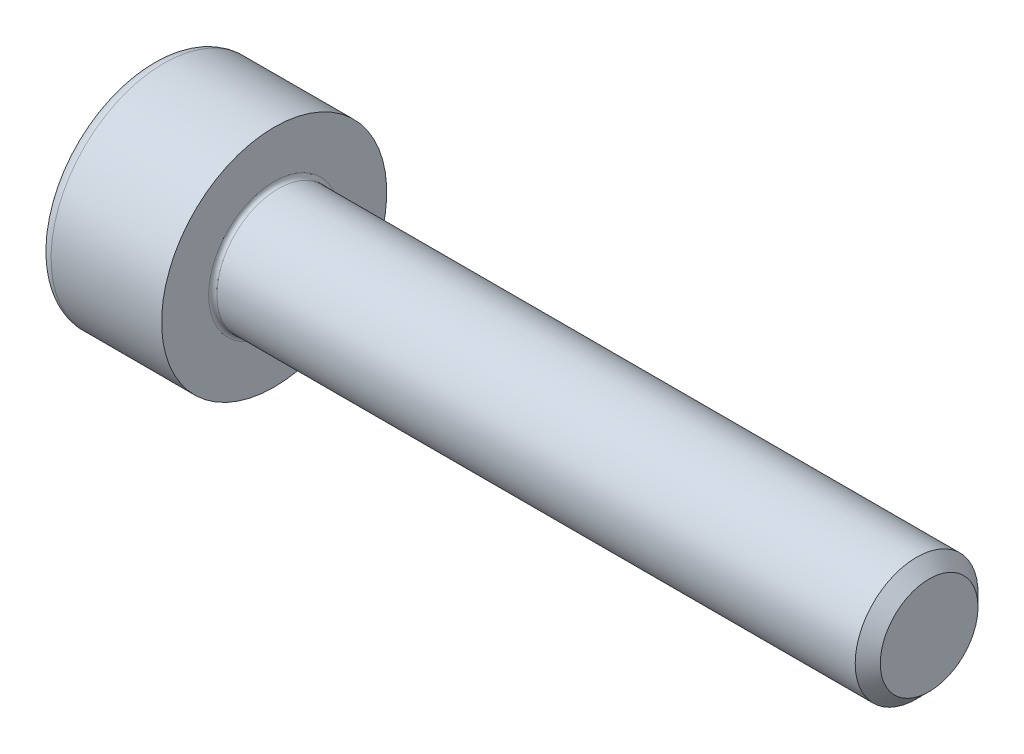
ISO-10303-21;
HEADER;
FILE_DESCRIPTION(('STEP AP214'),'2;1');
FILE_NAME('part.step','',(''),(''),'','','');
FILE_SCHEMA(('AUTOMOTIVE_DESIGN { 1 0 10303 214 1 1 1 1 }'));
ENDSEC;
DATA;
#1=APPLICATION_CONTEXT('core data for automotive mechanical design processes');
#2=APPLICATION_PROTOCOL_DEFINITION('international standard','automotive_design',2000,#1);
#3=PRODUCT_CONTEXT('',#1,'mechanical');
#4=PRODUCT('Part','Part','',(#3));
#5=PRODUCT_RELATED_PRODUCT_CATEGORY('part','',(#4));
#6=PRODUCT_DEFINITION_FORMATION('','',#4);
#7=PRODUCT_DEFINITION_CONTEXT('part definition',#1,'design');
#8=PRODUCT_DEFINITION('design','',#6,#7);
#9=PRODUCT_DEFINITION_SHAPE('','',#8);
#10=(LENGTH_UNIT() NAMED_UNIT(*) SI_UNIT(.MILLI.,.METRE.));
#11=(NAMED_UNIT(*) PLANE_ANGLE_UNIT() SI_UNIT($,.RADIAN.));
#12=(NAMED_UNIT(*) SI_UNIT($,.STERADIAN.) SOLID_ANGLE_UNIT());
#13=UNCERTAINTY_MEASURE_WITH_UNIT(LENGTH_MEASURE(1.E-05),#10,'distance_accuracy_value','');
#14=(GEOMETRIC_REPRESENTATION_CONTEXT(3) GLOBAL_UNCERTAINTY_ASSIGNED_CONTEXT((#13)) GLOBAL_UNIT_ASSIGNED_CONTEXT((#10,
#11,#12)) REPRESENTATION_CONTEXT('',''));
#15=CARTESIAN_POINT('',(0.,0.,0.));
#16=DIRECTION('',(0.,0.,1.));
#17=DIRECTION('',(1.,0.,0.));
#18=AXIS2_PLACEMENT_3D('',#15,#16,#17);
#19=CARTESIAN_POINT('',(-1.70499999995855,0.,0.));
#20=DIRECTION('',(-1.,0.,0.));
#21=DIRECTION('',(0.,0.,1.));
#22=AXIS2_PLACEMENT_3D('',#19,#20,#21);
#23=CONICAL_SURFACE('',#22,1.45203592700227,1.04719755108319);
#24=CARTESIAN_POINT('',(-0.86666666641122,0.,0.));
#25=VERTEX_POINT('',#24);
#26=VERTEX_LOOP('',#25);
#27=FACE_BOUND('',#26,.T.);
#28=CARTESIAN_POINT('',(-1.69999999996528,1.25000000000744,-0.721687836482736));
#29=CARTESIAN_POINT('',(-1.68168471566402,1.19507007027915,-0.753401646197935));
#30=CARTESIAN_POINT('',(-1.66502792314249,1.13966598617864,-0.78538920906757));
#31=CARTESIAN_POINT('',(-1.63595399207126,1.02789853332171,-0.849918178061155));
#32=CARTESIAN_POINT('',(-1.62354713765366,0.971533179320406,-0.882460730366776));
#33=CARTESIAN_POINT('',(-1.60423497427816,0.859500978894963,-0.947142551440311));
#34=CARTESIAN_POINT('',(-1.59720111718306,0.803851365232197,-0.979271870868808));
#35=CARTESIAN_POINT('',(-1.58880573001467,0.692290424699999,-1.04368160991612));
#36=CARTESIAN_POINT('',(-1.58743724616703,0.63637950304602,-1.07596179558369));
#37=CARTESIAN_POINT('',(-1.59029143128165,0.531915943916904,-1.13627385956739));
#38=CARTESIAN_POINT('',(-1.59381330319637,0.483347630833659,-1.16431478820008));
#39=CARTESIAN_POINT('',(-1.60497331288859,0.3865274113844,-1.22021396796211));
#40=CARTESIAN_POINT('',(-1.61261525917239,0.338275839643725,-1.24807202589541));
#41=CARTESIAN_POINT('',(-1.63171864578377,0.24125616141146,-1.3040863632395));
#42=CARTESIAN_POINT('',(-1.64326102633693,0.192500327875069,-1.3322355568563));
#43=CARTESIAN_POINT('',(-1.66945735048202,0.0957156437380676,-1.38811422029623));
#44=CARTESIAN_POINT('',(-1.68410514293131,0.0476855541702677,-1.4158444054374));
#45=CARTESIAN_POINT('',(-1.69999999996514,-7.02834388410815E-12,-1.44337567297812));
#46=B_SPLINE_CURVE_WITH_KNOTS('',3,(#28,#29,#30,#31,#32,#33,#34,#35,#36,#37,#38,#39,#40,#41,#42,
#43,#44,#45),.UNSPECIFIED.,.F.,.F.,(4,2,2,2,2,2,2,2,4),(0.,0.19813500723225,0.396746135660715,
0.590442253871009,0.783900555593058,0.952317364175078,1.12089012114997,1.29320101408408,
1.46517373347551),.UNSPECIFIED.);
#47=CARTESIAN_POINT('',(-1.69999999996537,1.25000000000372,-0.721687836489488));
#48=VERTEX_POINT('',#47);
#49=CARTESIAN_POINT('',(-1.69999999996513,0.,-1.44337567297811));
#50=VERTEX_POINT('',#49);
#51=EDGE_CURVE('E59',#48,#50,#46,.T.);
#52=ORIENTED_EDGE('',*,*,#51,.T.);
#53=CARTESIAN_POINT('',(-1.69999999996513,6.96634864365686E-12,-1.44337567297809));
#54=CARTESIAN_POINT('',(-1.68168471566388,-0.0549299297213223,-1.4116618632629));
#55=CARTESIAN_POINT('',(-1.66502792314236,-0.110334013821826,-1.37967430039327));
#56=CARTESIAN_POINT('',(-1.63595399207116,-0.222101466678736,-1.31514533139969));
#57=CARTESIAN_POINT('',(-1.62354713765357,-0.278466820680031,-1.28260277909408));
#58=CARTESIAN_POINT('',(-1.6042349742781,-0.390499021105457,-1.21792095802055));
#59=CARTESIAN_POINT('',(-1.59720111718301,-0.446148634768214,-1.18579163859206));
#60=CARTESIAN_POINT('',(-1.58880573001466,-0.557709575300394,-1.12138189954476));
#61=CARTESIAN_POINT('',(-1.58743724616703,-0.613620496954363,-1.0891017138772));
#62=CARTESIAN_POINT('',(-1.59029143128167,-0.718084056083497,-1.02878964989349));
#63=CARTESIAN_POINT('',(-1.59381330319641,-0.766652369166771,-1.00074872126077));
#64=CARTESIAN_POINT('',(-1.60497331288866,-0.863472588616084,-0.944849541498711));
#65=CARTESIAN_POINT('',(-1.61261525917248,-0.911724160356785,-0.916991483565395));
#66=CARTESIAN_POINT('',(-1.6317186457839,-1.0087438385891,-0.860977146221275));
#67=CARTESIAN_POINT('',(-1.64326102633708,-1.05749967212552,-0.832827952604459));
#68=CARTESIAN_POINT('',(-1.66945735048221,-1.15428435626258,-0.776949289164498));
#69=CARTESIAN_POINT('',(-1.68410514293153,-1.2023144458304,-0.749219104023312));
#70=CARTESIAN_POINT('',(-1.69999999996538,-1.25000000000772,-0.721687836482579));
#71=B_SPLINE_CURVE_WITH_KNOTS('',3,(#53,#54,#55,#56,#57,#58,#59,#60,#61,#62,#63,#64,#65,#66,#67,
#68,#69,#70),.UNSPECIFIED.,.F.,.F.,(4,2,2,2,2,2,2,2,4),(0.,0.198135007232214,0.396746135660643,
0.590442253870902,0.783900555592916,0.952317364175035,1.12089012115003,1.29320101408424,
1.46517373347577),.UNSPECIFIED.);
#72=CARTESIAN_POINT('',(-1.69999999996409,-1.25000000000386,-0.721687836484806));
#73=VERTEX_POINT('',#72);
#74=EDGE_CURVE('E229',#50,#73,#71,.T.);
#75=ORIENTED_EDGE('',*,*,#74,.T.);
#76=CARTESIAN_POINT('',(-1.6999999999654,-1.25,-0.721687836496031));
#77=CARTESIAN_POINT('',(-1.68168471566412,-1.25,-0.658260217065626));
#78=CARTESIAN_POINT('',(-1.66502792314258,-1.25,-0.594285091326349));
#79=CARTESIAN_POINT('',(-1.63595399207133,-1.25,-0.465227153339165));
#80=CARTESIAN_POINT('',(-1.62354713765372,-1.25,-0.400142048727915));
#81=CARTESIAN_POINT('',(-1.6042349742782,-1.25,-0.270778406580829));
#82=CARTESIAN_POINT('',(-1.59720111718309,-1.25,-0.206519767723829));
#83=CARTESIAN_POINT('',(-1.58880573001468,-1.25,-0.0777002896291891));
#84=CARTESIAN_POINT('',(-1.58743724616704,-1.25,-0.0131399182940519));
#85=CARTESIAN_POINT('',(-1.59029143128163,-1.25,0.10748420967346));
#86=CARTESIAN_POINT('',(-1.59381330319636,-1.25,0.163566066938955));
#87=CARTESIAN_POINT('',(-1.6049733128886,-1.25,0.275364426463211));
#88=CARTESIAN_POINT('',(-1.61261525917241,-1.25,0.331080542329912));
#89=CARTESIAN_POINT('',(-1.63171864578384,-1.25,0.443109217018291));
#90=CARTESIAN_POINT('',(-1.64326102633703,-1.25,0.499407604251992));
#91=CARTESIAN_POINT('',(-1.66945735048219,-1.25,0.611164931132053));
#92=CARTESIAN_POINT('',(-1.68410514293153,-1.25,0.666625301414493));
#93=CARTESIAN_POINT('',(-1.6999999999654,-1.25,0.721687836496027));
#94=B_SPLINE_CURVE_WITH_KNOTS('',3,(#76,#77,#78,#79,#80,#81,#82,#83,#84,#85,#86,#87,#88,#89,#90,
#91,#92,#93),.UNSPECIFIED.,.F.,.F.,(4,2,2,2,2,2,2,2,4),(0.,0.198135007232277,0.396746135660772,
0.59044225387109,0.783900555593163,0.952317364175483,1.12089012115067,1.2932010140851,
1.46517373347684),.UNSPECIFIED.);
#95=CARTESIAN_POINT('',(-1.69999999996539,-1.25000000000386,0.7216878364893));
#96=VERTEX_POINT('',#95);
#97=EDGE_CURVE('E123',#73,#96,#94,.T.);
#98=ORIENTED_EDGE('',*,*,#97,.T.);
#99=CARTESIAN_POINT('',(-1.69999999996537,-1.25000000000772,0.721687836482574));
#100=CARTESIAN_POINT('',(-1.6816847156641,-1.19507007027942,0.753401646197776));
#101=CARTESIAN_POINT('',(-1.66502792314257,-1.13966598617891,0.785389209067413));
#102=CARTESIAN_POINT('',(-1.63595399207132,-1.02789853332197,0.849918178061004));
#103=CARTESIAN_POINT('',(-1.62354713765371,-0.971533179320663,0.882460730366628));
#104=CARTESIAN_POINT('',(-1.60423497427819,-0.85950097889521,0.947142551440169));
#105=CARTESIAN_POINT('',(-1.59720111718308,-0.803851365232439,0.979271870868669));
#106=CARTESIAN_POINT('',(-1.58880573001468,-0.69229042470023,1.04368160991599));
#107=CARTESIAN_POINT('',(-1.58743724616704,-0.636379503046245,1.07596179558356));
#108=CARTESIAN_POINT('',(-1.59029143128164,-0.531915943917105,1.13627385956727));
#109=CARTESIAN_POINT('',(-1.59381330319636,-0.483347630833842,1.16431478819998));
#110=CARTESIAN_POINT('',(-1.60497331288857,-0.386527411384547,1.22021396796203));
#111=CARTESIAN_POINT('',(-1.61261525917237,-0.338275839643855,1.24807202589534));
#112=CARTESIAN_POINT('',(-1.63171864578375,-0.241256161411553,1.30408636323945));
#113=CARTESIAN_POINT('',(-1.64326102633691,-0.192500327875143,1.33223555685626));
#114=CARTESIAN_POINT('',(-1.66945735048201,-0.0957156437381047,1.38811422029621));
#115=CARTESIAN_POINT('',(-1.68410514293131,-0.0476855541702868,1.41584440543739));
#116=CARTESIAN_POINT('',(-1.69999999996514,7.02705384791469E-12,1.44337567297812));
#117=B_SPLINE_CURVE_WITH_KNOTS('',3,(#99,#100,#101,#102,#103,#104,#105,#106,#107,#108,#109,#110,
#111,#112,#113,#114,#115,#116),.UNSPECIFIED.,.F.,.F.,(4,2,2,2,2,2,2,2,4),(0.,0.198135007232271,
0.396746135660759,0.590442253871073,0.783900555593142,0.952317364175224,1.12089012115018,
1.29320101408435,1.46517373347584),.UNSPECIFIED.);
#118=CARTESIAN_POINT('',(-1.70000000005341,-3.42357506905061E-12,1.44337567304797));
#119=VERTEX_POINT('',#118);
#120=EDGE_CURVE('E129',#96,#119,#117,.T.);
#121=ORIENTED_EDGE('',*,*,#120,.T.);
#122=CARTESIAN_POINT('',(-1.69999999996513,-6.96766034100866E-12,1.44337567297809));
#123=CARTESIAN_POINT('',(-1.68168471566388,0.0549299297213209,1.4116618632629));
#124=CARTESIAN_POINT('',(-1.66502792314236,0.110334013821825,1.37967430039327));
#125=CARTESIAN_POINT('',(-1.63595399207116,0.222101466678735,1.31514533139969));
#126=CARTESIAN_POINT('',(-1.62354713765357,0.27846682068003,1.28260277909408));
#127=CARTESIAN_POINT('',(-1.6042349742781,0.390499021105456,1.21792095802055));
#128=CARTESIAN_POINT('',(-1.59720111718301,0.446148634768213,1.18579163859206));
#129=CARTESIAN_POINT('',(-1.58880573001466,0.557709575300392,1.12138189954476));
#130=CARTESIAN_POINT('',(-1.58743724616703,0.613620496954361,1.0891017138772));
#131=CARTESIAN_POINT('',(-1.59029143128167,0.718084056083501,1.02878964989348));
#132=CARTESIAN_POINT('',(-1.59381330319641,0.76665236916678,1.00074872126076));
#133=CARTESIAN_POINT('',(-1.60497331288866,0.863472588616105,0.944849541498697));
#134=CARTESIAN_POINT('',(-1.61261525917248,0.911724160356812,0.916991483565378));
#135=CARTESIAN_POINT('',(-1.63171864578391,1.00874383858914,0.860977146221251));
#136=CARTESIAN_POINT('',(-1.64326102633709,1.05749967212557,0.832827952604432));
#137=CARTESIAN_POINT('',(-1.66945735048222,1.15428435626263,0.776949289164464));
#138=CARTESIAN_POINT('',(-1.68410514293154,1.20231444583046,0.749219104023275));
#139=CARTESIAN_POINT('',(-1.6999999999654,1.25000000000779,0.721687836482538));
#140=B_SPLINE_CURVE_WITH_KNOTS('',3,(#122,#123,#124,#125,#126,#127,#128,#129,#130,#131,#132,
#133,#134,#135,#136,#137,#138,#139),.UNSPECIFIED.,.F.,.F.,(4,2,2,2,2,2,2,2,4),(0.,
0.198135007232214,0.396746135660643,0.590442253870902,0.783900555592917,0.952317364175056,
1.12089012115007,1.29320101408431,1.46517373347585),.UNSPECIFIED.);
#141=CARTESIAN_POINT('',(-1.69999999996539,1.2500000000039,0.721687836489245));
#142=VERTEX_POINT('',#141);
#143=EDGE_CURVE('E135',#119,#142,#140,.T.);
#144=ORIENTED_EDGE('',*,*,#143,.T.);
#145=CARTESIAN_POINT('',(-1.69999999996538,1.25,0.721687836495952));
#146=CARTESIAN_POINT('',(-1.6816847156641,1.25,0.658260217065549));
#147=CARTESIAN_POINT('',(-1.66502792314257,1.25,0.594285091326274));
#148=CARTESIAN_POINT('',(-1.63595399207132,1.25,0.465227153339091));
#149=CARTESIAN_POINT('',(-1.62354713765371,1.25,0.400142048727843));
#150=CARTESIAN_POINT('',(-1.60423497427819,1.25,0.27077840658076));
#151=CARTESIAN_POINT('',(-1.59720111718308,1.25,0.206519767723761));
#152=CARTESIAN_POINT('',(-1.58880573001468,1.25,0.0777002896291249));
#153=CARTESIAN_POINT('',(-1.58743724616703,1.25,0.0131399182939894));
#154=CARTESIAN_POINT('',(-1.59029143128164,1.25,-0.107484209673534));
#155=CARTESIAN_POINT('',(-1.59381330319637,1.25,-0.163566066939042));
#156=CARTESIAN_POINT('',(-1.60497331288861,1.25,-0.275364426463323));
#157=CARTESIAN_POINT('',(-1.61261525917243,1.25,-0.331080542330037));
#158=CARTESIAN_POINT('',(-1.63171864578387,1.25,-0.443109217018442));
#159=CARTESIAN_POINT('',(-1.64326102633706,1.25,-0.499407604252156));
#160=CARTESIAN_POINT('',(-1.66945735048224,1.25,-0.611164931132242));
#161=CARTESIAN_POINT('',(-1.68410514293158,1.25,-0.666625301414695));
#162=CARTESIAN_POINT('',(-1.69999999996546,1.25,-0.72168783649624));
#163=B_SPLINE_CURVE_WITH_KNOTS('',3,(#145,#146,#147,#148,#149,#150,#151,#152,#153,#154,#155,
#156,#157,#158,#159,#160,#161,#162),.UNSPECIFIED.,.F.,.F.,(4,2,2,2,2,2,2,2,4),(0.,
0.198135007232272,0.396746135660762,0.590442253871075,0.783900555593143,0.952317364175501,
1.12089012115073,1.2932010140852,1.46517373347698),.UNSPECIFIED.);
#164=EDGE_CURVE('E141',#142,#48,#163,.T.);
#165=ORIENTED_EDGE('',*,*,#164,.T.);
#166=EDGE_LOOP('',(#52,#75,#98,#121,#144,#165));
#167=FACE_BOUND('',#166,.T.);
#168=ADVANCED_FACE('F17',(#27,#167),#23,.F.);
#169=CARTESIAN_POINT('',(-2.99999999999999,0.,-1.44337567297407));
#170=DIRECTION('',(0.,-0.5,-0.866025403784439));
#171=DIRECTION('',(0.,0.866025403784439,-0.5));
#172=AXIS2_PLACEMENT_3D('',#169,#170,#171);
#173=PLANE('',#172);
#174=DIRECTION('',(0.,0.866025403784438,-0.500000000000001));
#175=VECTOR('',#174,1.);
#176=CARTESIAN_POINT('',(-2.99999999999999,-1.25,-0.721687836487034));
#177=LINE('',#176,#175);
#178=CARTESIAN_POINT('',(-2.99999999999999,-1.25,-0.721687836487034));
#179=VERTEX_POINT('',#178);
#180=CARTESIAN_POINT('',(-2.99999999999999,-1.11901938874752E-13,-1.44337567297412));
#181=VERTEX_POINT('',#180);
#182=EDGE_CURVE('E117',#179,#181,#177,.T.);
#183=ORIENTED_EDGE('',*,*,#182,.F.);
#184=DIRECTION('',(1.,0.,0.));
#185=VECTOR('',#184,1.);
#186=CARTESIAN_POINT('',(-2.99999999999999,-1.25,-0.721687836487034));
#187=LINE('',#186,#185);
#188=EDGE_CURVE('E114',#179,#73,#187,.T.);
#189=ORIENTED_EDGE('',*,*,#188,.T.);
#190=ORIENTED_EDGE('',*,*,#74,.F.);
#191=DIRECTION('',(1.,0.,0.));
#192=VECTOR('',#191,1.);
#193=CARTESIAN_POINT('',(-2.99999999999999,-2.41777084464267E-13,-1.4433756729742));
#194=LINE('',#193,#192);
#195=EDGE_CURVE('E144',#50,#181,#194,.F.);
#196=ORIENTED_EDGE('',*,*,#195,.T.);
#197=EDGE_LOOP('',(#183,#189,#190,#196));
#198=FACE_BOUND('',#197,.T.);
#199=ADVANCED_FACE('F64',(#198),#173,.F.);
#200=CARTESIAN_POINT('',(-2.99999999999999,1.25,-0.721687836487033));
#201=DIRECTION('',(0.,0.5,-0.866025403784439));
#202=DIRECTION('',(0.,0.866025403784439,0.5));
#203=AXIS2_PLACEMENT_3D('',#200,#201,#202);
#204=PLANE('',#203);
#205=DIRECTION('',(0.,0.866025403784438,0.500000000000001));
#206=VECTOR('',#205,1.);
#207=CARTESIAN_POINT('',(-2.99999999999999,0.,-1.44337567297407));
#208=LINE('',#207,#206);
#209=CARTESIAN_POINT('',(-2.99999999999999,1.25,-0.721687836487378));
#210=VERTEX_POINT('',#209);
#211=EDGE_CURVE('E151',#181,#210,#208,.T.);
#212=ORIENTED_EDGE('',*,*,#211,.F.);
#213=ORIENTED_EDGE('',*,*,#195,.F.);
#214=ORIENTED_EDGE('',*,*,#51,.F.);
#215=DIRECTION('',(1.,0.,0.));
#216=VECTOR('',#215,1.);
#217=CARTESIAN_POINT('',(-2.99999999999999,1.25,-0.721687836487585));
#218=LINE('',#217,#216);
#219=EDGE_CURVE('E138',#48,#210,#218,.F.);
#220=ORIENTED_EDGE('',*,*,#219,.T.);
#221=EDGE_LOOP('',(#212,#213,#214,#220));
#222=FACE_BOUND('',#221,.T.);
#223=ADVANCED_FACE('F70',(#222),#204,.F.);
#224=CARTESIAN_POINT('',(-2.99999999999999,1.25,0.721687836487031));
#225=DIRECTION('',(0.,1.,0.));
#226=DIRECTION('',(0.,0.,1.));
#227=AXIS2_PLACEMENT_3D('',#224,#225,#226);
#228=PLANE('',#227);
#229=DIRECTION('',(0.,0.,1.));
#230=VECTOR('',#229,1.);
#231=CARTESIAN_POINT('',(-2.99999999999999,1.25,0.));
#232=LINE('',#231,#230);
#233=CARTESIAN_POINT('',(-2.99999999999999,1.25000000000015,0.721687836486948));
#234=VERTEX_POINT('',#233);
#235=EDGE_CURVE('E167',#210,#234,#232,.T.);
#236=ORIENTED_EDGE('',*,*,#235,.F.);
#237=ORIENTED_EDGE('',*,*,#219,.F.);
#238=ORIENTED_EDGE('',*,*,#164,.F.);
#239=DIRECTION('',(1.,0.,0.));
#240=VECTOR('',#239,1.);
#241=CARTESIAN_POINT('',(-2.99999999999999,1.25000000000024,0.721687836486897));
#242=LINE('',#241,#240);
#243=EDGE_CURVE('E132',#142,#234,#242,.F.);
#244=ORIENTED_EDGE('',*,*,#243,.T.);
#245=EDGE_LOOP('',(#236,#237,#238,#244));
#246=FACE_BOUND('',#245,.T.);
#247=ADVANCED_FACE('F211',(#246),#228,.F.);
#248=CARTESIAN_POINT('',(-2.99999999999999,0.,1.44337567297407));
#249=DIRECTION('',(0.,0.500000000000001,0.866025403784438));
#250=DIRECTION('',(0.,-0.866025403784438,0.500000000000001));
#251=AXIS2_PLACEMENT_3D('',#248,#249,#250);
#252=PLANE('',#251);
#253=DIRECTION('',(0.,-0.866025403784437,0.500000000000002));
#254=VECTOR('',#253,1.);
#255=CARTESIAN_POINT('',(-2.99999999999999,1.25,0.721687836487032));
#256=LINE('',#255,#254);
#257=CARTESIAN_POINT('',(-2.99999999999999,1.51248387988399E-13,1.44337567297415));
#258=VERTEX_POINT('',#257);
#259=EDGE_CURVE('E162',#234,#258,#256,.T.);
#260=ORIENTED_EDGE('',*,*,#259,.F.);
#261=ORIENTED_EDGE('',*,*,#243,.F.);
#262=ORIENTED_EDGE('',*,*,#143,.F.);
#263=DIRECTION('',(1.,0.,0.));
#264=VECTOR('',#263,1.);
#265=CARTESIAN_POINT('',(-2.99999999999999,2.41126563160776E-13,1.4433756729742));
#266=LINE('',#265,#264);
#267=EDGE_CURVE('E126',#119,#258,#266,.F.);
#268=ORIENTED_EDGE('',*,*,#267,.T.);
#269=EDGE_LOOP('',(#260,#261,#262,#268));
#270=FACE_BOUND('',#269,.T.);
#271=ADVANCED_FACE('F206',(#270),#252,.F.);
#272=CARTESIAN_POINT('',(-2.99999999999999,-1.25,0.721687836487033));
#273=DIRECTION('',(0.,-0.5,0.866025403784439));
#274=DIRECTION('',(0.,-0.866025403784439,-0.5));
#275=AXIS2_PLACEMENT_3D('',#272,#273,#274);
#276=PLANE('',#275);
#277=DIRECTION('',(0.,-0.866025403784438,-0.500000000000002));
#278=VECTOR('',#277,1.);
#279=CARTESIAN_POINT('',(-2.99999999999999,0.,1.44337567297407));
#280=LINE('',#279,#278);
#281=CARTESIAN_POINT('',(-2.99999999999999,-1.25,0.721687836487205));
#282=VERTEX_POINT('',#281);
#283=EDGE_CURVE('E157',#258,#282,#280,.T.);
#284=ORIENTED_EDGE('',*,*,#283,.F.);
#285=ORIENTED_EDGE('',*,*,#267,.F.);
#286=ORIENTED_EDGE('',*,*,#120,.F.);
#287=DIRECTION('',(1.,0.,0.));
#288=VECTOR('',#287,1.);
#289=CARTESIAN_POINT('',(-2.99999999999999,-1.25,0.721687836487308));
#290=LINE('',#289,#288);
#291=EDGE_CURVE('E118',#96,#282,#290,.F.);
#292=ORIENTED_EDGE('',*,*,#291,.T.);
#293=EDGE_LOOP('',(#284,#285,#286,#292));
#294=FACE_BOUND('',#293,.T.);
#295=ADVANCED_FACE('F201',(#294),#276,.F.);
#296=CARTESIAN_POINT('',(-2.99999999999999,-1.25,-0.721687836487032));
#297=DIRECTION('',(0.,-1.,0.));
#298=DIRECTION('',(1.,0.,0.));
#299=AXIS2_PLACEMENT_3D('',#296,#297,#298);
#300=PLANE('',#299);
#301=DIRECTION('',(0.,0.,1.));
#302=VECTOR('',#301,1.);
#303=CARTESIAN_POINT('',(-2.99999999999999,-1.25,0.));
#304=LINE('',#303,#302);
#305=EDGE_CURVE('E154',#282,#179,#304,.F.);
#306=ORIENTED_EDGE('',*,*,#305,.F.);
#307=ORIENTED_EDGE('',*,*,#291,.F.);
#308=ORIENTED_EDGE('',*,*,#97,.F.);
#309=ORIENTED_EDGE('',*,*,#188,.F.);
#310=EDGE_LOOP('',(#306,#307,#308,#309));
#311=FACE_BOUND('',#310,.T.);
#312=ADVANCED_FACE('F197',(#311),#300,.F.);
#313=CARTESIAN_POINT('',(-2.99999999999999,2.09668783648703,0.));
#314=DIRECTION('',(-1.,0.,0.));
#315=DIRECTION('',(0.,-1.,0.));
#316=AXIS2_PLACEMENT_3D('',#313,#314,#315);
#317=PLANE('',#316);
#318=CARTESIAN_POINT('',(-2.99999999999999,0.,0.));
#319=DIRECTION('',(1.,0.,0.));
#320=DIRECTION('',(0.,0.,-1.));
#321=AXIS2_PLACEMENT_3D('',#318,#319,#320);
#322=CIRCLE('',#321,2.45);
#323=CARTESIAN_POINT('',(-2.99999999999999,0.,-2.45));
#324=VERTEX_POINT('',#323);
#325=EDGE_CURVE('E113',#324,#324,#322,.T.);
#326=ORIENTED_EDGE('',*,*,#325,.F.);
#327=EDGE_LOOP('',(#326));
#328=FACE_BOUND('',#327,.T.);
#329=ORIENTED_EDGE('',*,*,#283,.T.);
#330=ORIENTED_EDGE('',*,*,#305,.T.);
#331=ORIENTED_EDGE('',*,*,#182,.T.);
#332=ORIENTED_EDGE('',*,*,#211,.T.);
#333=ORIENTED_EDGE('',*,*,#235,.T.);
#334=ORIENTED_EDGE('',*,*,#259,.T.);
#335=EDGE_LOOP('',(#329,#330,#331,#332,#333,#334));
#336=FACE_BOUND('',#335,.T.);
#337=ADVANCED_FACE('F200',(#328,#336),#317,.T.);
#338=CARTESIAN_POINT('',(-2.69999999999999,0.,0.));
#339=DIRECTION('',(1.,0.,0.));
#340=DIRECTION('',(0.,0.,-1.));
#341=AXIS2_PLACEMENT_3D('',#338,#339,#340);
#342=TOROIDAL_SURFACE('',#341,2.45,0.300000000000001);
#343=CARTESIAN_POINT('',(-2.69999999999999,0.,0.));
#344=DIRECTION('',(1.,0.,0.));
#345=DIRECTION('',(0.,1.,0.));
#346=AXIS2_PLACEMENT_3D('',#343,#344,#345);
#347=CIRCLE('',#346,2.75);
#348=CARTESIAN_POINT('',(-2.69999999999999,2.75,0.));
#349=VERTEX_POINT('',#348);
#350=EDGE_CURVE('E105',#349,#349,#347,.T.);
#351=ORIENTED_EDGE('',*,*,#350,.F.);
#352=EDGE_LOOP('',(#351));
#353=FACE_BOUND('',#352,.T.);
#354=ORIENTED_EDGE('',*,*,#325,.T.);
#355=EDGE_LOOP('',(#354));
#356=FACE_BOUND('',#355,.T.);
#357=ADVANCED_FACE('F269',(#353,#356),#342,.T.);
#358=CARTESIAN_POINT('',(-1.5,0.,0.));
#359=DIRECTION('',(1.,0.,0.));
#360=DIRECTION('',(0.,1.,0.));
#361=AXIS2_PLACEMENT_3D('',#358,#359,#360);
#362=CYLINDRICAL_SURFACE('',#361,2.75);
#363=ORIENTED_EDGE('',*,*,#350,.T.);
#364=EDGE_LOOP('',(#363));
#365=FACE_BOUND('',#364,.T.);
#366=CARTESIAN_POINT('',(0.,0.,0.));
#367=DIRECTION('',(1.,0.,0.));
#368=DIRECTION('',(0.,1.,0.));
#369=AXIS2_PLACEMENT_3D('',#366,#367,#368);
#370=CIRCLE('',#369,2.75);
#371=CARTESIAN_POINT('',(0.,2.75,0.));
#372=VERTEX_POINT('',#371);
#373=EDGE_CURVE('E104',#372,#372,#370,.T.);
#374=ORIENTED_EDGE('',*,*,#373,.F.);
#375=EDGE_LOOP('',(#374));
#376=FACE_BOUND('',#375,.T.);
#377=ADVANCED_FACE('F94',(#365,#376),#362,.T.);
#378=CARTESIAN_POINT('',(0.,2.125,0.));
#379=DIRECTION('',(1.,0.,0.));
#380=DIRECTION('',(0.,1.,0.));
#381=AXIS2_PLACEMENT_3D('',#378,#379,#380);
#382=PLANE('',#381);
#383=ORIENTED_EDGE('',*,*,#373,.T.);
#384=EDGE_LOOP('',(#383));
#385=FACE_BOUND('',#384,.T.);
#386=CARTESIAN_POINT('',(0.,0.,-1.6));
#387=CARTESIAN_POINT('',(0.,-0.304449951016725,-1.6001009257119));
#388=CARTESIAN_POINT('',(0.,-0.588951535298995,-1.48766128169989));
#389=CARTESIAN_POINT('',(0.,-0.896214094659146,-1.36622613089104));
#390=CARTESIAN_POINT('',(0.,-1.13137084989847,-1.13137084989848));
#391=CARTESIAN_POINT('',(0.,-1.36508531011187,-0.897956014889474));
#392=CARTESIAN_POINT('',(0.,-1.48766128169989,-0.588951535299007));
#393=CARTESIAN_POINT('',(0.,-1.59980408211201,-0.306248267829627));
#394=CARTESIAN_POINT('',(0.,-1.6,0.));
#395=CARTESIAN_POINT('',(0.,-1.60019461578501,0.304212890729989));
#396=CARTESIAN_POINT('',(0.,-1.48766128169989,0.588951535298987));
#397=CARTESIAN_POINT('',(0.,-1.36622613089144,0.89621409465832));
#398=CARTESIAN_POINT('',(0.,-1.13137084989848,1.13137084989847));
#399=CARTESIAN_POINT('',(0.,-0.897956014890013,1.36508531011175));
#400=CARTESIAN_POINT('',(0.,-0.588951535299002,1.48766128169989));
#401=CARTESIAN_POINT('',(0.,-0.306010103754814,1.59989855709463));
#402=CARTESIAN_POINT('',(0.,0.,1.6));
#403=B_SPLINE_CURVE_WITH_KNOTS('',2,(#386,#387,#388,#389,#390,#391,#392,#393,#394,#395,#396,
#397,#398,#399,#400,#401,#402),.UNSPECIFIED.,.F.,.F.,(3,2,2,2,2,2,2,2,3),(0.,0.125,0.25,0.375,
0.5,0.625,0.75,0.875,1.),.UNSPECIFIED.);
#404=CARTESIAN_POINT('',(0.,0.,-1.6));
#405=VERTEX_POINT('',#404);
#406=CARTESIAN_POINT('',(0.,0.,1.6));
#407=VERTEX_POINT('',#406);
#408=EDGE_CURVE('E34',#405,#407,#403,.T.);
#409=ORIENTED_EDGE('',*,*,#408,.T.);
#410=CARTESIAN_POINT('',(0.,0.,1.6));
#411=CARTESIAN_POINT('',(0.,0.304449951016785,1.6001009257119));
#412=CARTESIAN_POINT('',(0.,0.588951535299,1.48766128169989));
#413=CARTESIAN_POINT('',(0.,0.89621409465884,1.36622613089113));
#414=CARTESIAN_POINT('',(0.,1.13137084989848,1.13137084989847));
#415=CARTESIAN_POINT('',(0.,1.36508499852708,0.897956326075019));
#416=CARTESIAN_POINT('',(0.,1.48766128169989,0.588951535298992));
#417=CARTESIAN_POINT('',(0.,1.59990576220706,0.305992374545344));
#418=CARTESIAN_POINT('',(0.,1.6,0.));
#419=CARTESIAN_POINT('',(0.,1.60009376834225,-0.30446805689882));
#420=CARTESIAN_POINT('',(0.,1.48766128169989,-0.588951535299003));
#421=CARTESIAN_POINT('',(0.,1.36622613380686,-0.896214091739088));
#422=CARTESIAN_POINT('',(0.,1.13137084989847,-1.13137084989848));
#423=CARTESIAN_POINT('',(0.,0.897956014889921,-1.36508531011191));
#424=CARTESIAN_POINT('',(0.,0.588951535298992,-1.48766128169989));
#425=CARTESIAN_POINT('',(0.,0.306010103754522,-1.59989855709463));
#426=CARTESIAN_POINT('',(0.,0.,-1.6));
#427=B_SPLINE_CURVE_WITH_KNOTS('',2,(#410,#411,#412,#413,#414,#415,#416,#417,#418,#419,#420,
#421,#422,#423,#424,#425,#426),.UNSPECIFIED.,.F.,.F.,(3,2,2,2,2,2,2,2,3),(0.,0.125,0.25,0.375,
0.5,0.625,0.75,0.875,1.),.UNSPECIFIED.);
#428=EDGE_CURVE('E101',#407,#405,#427,.T.);
#429=ORIENTED_EDGE('',*,*,#428,.T.);
#430=EDGE_LOOP('',(#409,#429));
#431=FACE_BOUND('',#430,.T.);
#432=ADVANCED_FACE('F89',(#385,#431),#382,.T.);
#433=CARTESIAN_POINT('',(16.,0.75,0.));
#434=DIRECTION('',(1.,0.,0.));
#435=DIRECTION('',(0.,1.,0.));
#436=AXIS2_PLACEMENT_3D('',#433,#434,#435);
#437=PLANE('',#436);
#438=CARTESIAN_POINT('',(16.0000000000764,0.,0.));
#439=DIRECTION('',(-1.,0.,0.));
#440=DIRECTION('',(0.,0.,1.));
#441=AXIS2_PLACEMENT_3D('',#438,#439,#440);
#442=CIRCLE('',#441,1.1932749999346);
#443=CARTESIAN_POINT('',(16.0000000000764,0.,1.1932749999346));
#444=VERTEX_POINT('',#443);
#445=EDGE_CURVE('E180',#444,#444,#442,.T.);
#446=ORIENTED_EDGE('',*,*,#445,.F.);
#447=EDGE_LOOP('',(#446));
#448=FACE_BOUND('',#447,.T.);
#449=ADVANCED_FACE('F86',(#448),#437,.T.);
#450=CARTESIAN_POINT('',(0.100000000000002,0.,0.));
#451=DIRECTION('',(1.,0.,0.));
#452=DIRECTION('',(0.,1.,0.));
#453=AXIS2_PLACEMENT_3D('',#450,#451,#452);
#454=TOROIDAL_SURFACE('',#453,1.6,0.1);
#455=ORIENTED_EDGE('',*,*,#408,.F.);
#456=ORIENTED_EDGE('',*,*,#428,.F.);
#457=EDGE_LOOP('',(#455,#456));
#458=FACE_BOUND('',#457,.T.);
#459=CARTESIAN_POINT('',(0.100000000000003,0.,0.));
#460=DIRECTION('',(1.,0.,0.));
#461=DIRECTION('',(0.,1.,0.));
#462=AXIS2_PLACEMENT_3D('',#459,#460,#461);
#463=CIRCLE('',#462,1.5);
#464=CARTESIAN_POINT('',(0.100000000000003,1.5,0.));
#465=VERTEX_POINT('',#464);
#466=EDGE_CURVE('E21',#465,#465,#463,.T.);
#467=ORIENTED_EDGE('',*,*,#466,.F.);
#468=EDGE_LOOP('',(#467));
#469=FACE_BOUND('',#468,.T.);
#470=ADVANCED_FACE('F19',(#458,#469),#454,.F.);
#471=CARTESIAN_POINT('',(15.6932750001602,0.,0.));
#472=DIRECTION('',(-1.,0.,0.));
#473=DIRECTION('',(0.,0.,1.));
#474=AXIS2_PLACEMENT_3D('',#471,#472,#473);
#475=CONICAL_SURFACE('',#474,1.49999999985084,0.785398163397448);
#476=CARTESIAN_POINT('',(15.693275,0.,0.));
#477=DIRECTION('',(1.,0.,0.));
#478=DIRECTION('',(0.,1.,0.));
#479=AXIS2_PLACEMENT_3D('',#476,#477,#478);
#480=CIRCLE('',#479,1.5);
#481=CARTESIAN_POINT('',(15.693275,1.5,0.));
#482=VERTEX_POINT('',#481);
#483=EDGE_CURVE('E11',#482,#482,#480,.F.);
#484=ORIENTED_EDGE('',*,*,#483,.F.);
#485=EDGE_LOOP('',(#484));
#486=FACE_BOUND('',#485,.T.);
#487=ORIENTED_EDGE('',*,*,#445,.T.);
#488=EDGE_LOOP('',(#487));
#489=FACE_BOUND('',#488,.T.);
#490=ADVANCED_FACE('F76',(#486,#489),#475,.T.);
#491=CARTESIAN_POINT('',(8.625,0.,0.));
#492=DIRECTION('',(1.,0.,0.));
#493=DIRECTION('',(0.,1.,0.));
#494=AXIS2_PLACEMENT_3D('',#491,#492,#493);
#495=CYLINDRICAL_SURFACE('',#494,1.5);
#496=ORIENTED_EDGE('',*,*,#483,.T.);
#497=EDGE_LOOP('',(#496));
#498=FACE_BOUND('',#497,.T.);
#499=ORIENTED_EDGE('',*,*,#466,.T.);
#500=EDGE_LOOP('',(#499));
#501=FACE_BOUND('',#500,.T.);
#502=ADVANCED_FACE('F74',(#498,#501),#495,.T.);
#503=CLOSED_SHELL('',(#168,#199,#223,#247,#271,#295,#312,#337,#357,#377,#432,#449,#470,#490,#502));
#504=MANIFOLD_SOLID_BREP('B1',#503);
#505=ADVANCED_BREP_SHAPE_REPRESENTATION('',(#18,#504),#14);
#506=SHAPE_DEFINITION_REPRESENTATION(#9,#505);
ENDSEC;
END-ISO-10303-21;
